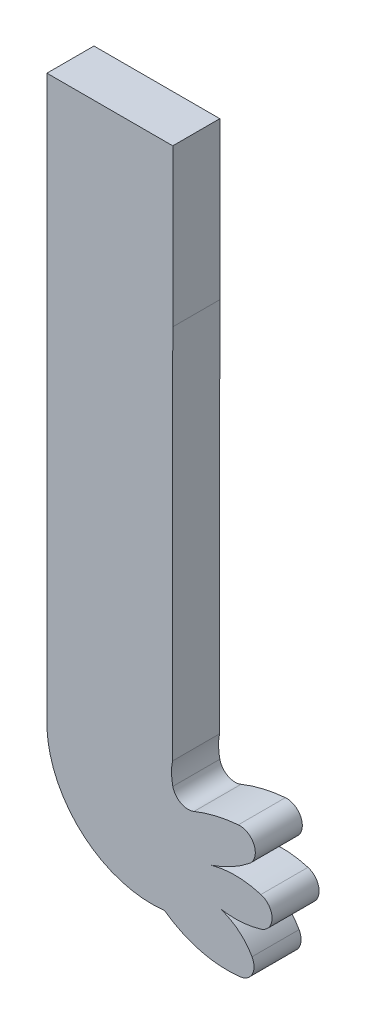
ISO-10303-21;
HEADER;
FILE_DESCRIPTION(('STEP AP214'),'2;1');
FILE_NAME('part.step','',(''),(''),'','','');
FILE_SCHEMA(('AUTOMOTIVE_DESIGN { 1 0 10303 214 1 1 1 1 }'));
ENDSEC;
DATA;
#1=APPLICATION_CONTEXT('core data for automotive mechanical design processes');
#2=APPLICATION_PROTOCOL_DEFINITION('international standard','automotive_design',2000,#1);
#3=PRODUCT_CONTEXT('',#1,'mechanical');
#4=PRODUCT('Part','Part','',(#3));
#5=PRODUCT_RELATED_PRODUCT_CATEGORY('part','',(#4));
#6=PRODUCT_DEFINITION_FORMATION('','',#4);
#7=PRODUCT_DEFINITION_CONTEXT('part definition',#1,'design');
#8=PRODUCT_DEFINITION('design','',#6,#7);
#9=PRODUCT_DEFINITION_SHAPE('','',#8);
#10=(LENGTH_UNIT() NAMED_UNIT(*) SI_UNIT(.MILLI.,.METRE.));
#11=(NAMED_UNIT(*) PLANE_ANGLE_UNIT() SI_UNIT($,.RADIAN.));
#12=(NAMED_UNIT(*) SI_UNIT($,.STERADIAN.) SOLID_ANGLE_UNIT());
#13=UNCERTAINTY_MEASURE_WITH_UNIT(LENGTH_MEASURE(1.E-05),#10,'distance_accuracy_value','');
#14=(GEOMETRIC_REPRESENTATION_CONTEXT(3) GLOBAL_UNCERTAINTY_ASSIGNED_CONTEXT((#13)) GLOBAL_UNIT_ASSIGNED_CONTEXT((#10,
#11,#12)) REPRESENTATION_CONTEXT('',''));
#15=CARTESIAN_POINT('',(0.,0.,0.));
#16=DIRECTION('',(0.,0.,1.));
#17=DIRECTION('',(1.,0.,0.));
#18=AXIS2_PLACEMENT_3D('',#15,#16,#17);
#19=CARTESIAN_POINT('',(34.1484606948639,3.81736043369854,3.));
#20=DIRECTION('',(0.,0.,-1.));
#21=DIRECTION('',(-1.,0.,0.));
#22=AXIS2_PLACEMENT_3D('',#19,#20,#21);
#23=CYLINDRICAL_SURFACE('',#22,6.68741064980928);
#24=CARTESIAN_POINT('',(34.1484606948639,3.81736043369854,0.));
#25=DIRECTION('',(0.,0.,1.));
#26=DIRECTION('',(1.,0.,0.));
#27=AXIS2_PLACEMENT_3D('',#24,#25,#26);
#28=CIRCLE('',#27,6.68741064980928);
#29=CARTESIAN_POINT('',(27.4679410773858,3.51384957776011,0.));
#30=VERTEX_POINT('',#29);
#31=CARTESIAN_POINT('',(34.9679410773858,-2.81965042223987,0.));
#32=VERTEX_POINT('',#31);
#33=EDGE_CURVE('E178',#30,#32,#28,.T.);
#34=ORIENTED_EDGE('',*,*,#33,.T.);
#35=DIRECTION('',(0.,0.,-1.));
#36=VECTOR('',#35,1.);
#37=CARTESIAN_POINT('',(34.9679410773858,-2.81965042223987,3.));
#38=LINE('',#37,#36);
#39=CARTESIAN_POINT('',(34.9679410773858,-2.81965042223987,3.));
#40=VERTEX_POINT('',#39);
#41=EDGE_CURVE('E11',#40,#32,#38,.T.);
#42=ORIENTED_EDGE('',*,*,#41,.F.);
#43=CARTESIAN_POINT('',(34.1484606948639,3.81736043369854,3.));
#44=DIRECTION('',(0.,0.,1.));
#45=DIRECTION('',(1.,0.,0.));
#46=AXIS2_PLACEMENT_3D('',#43,#44,#45);
#47=CIRCLE('',#46,6.68741064980928);
#48=CARTESIAN_POINT('',(27.4679410773858,3.51384957776011,3.));
#49=VERTEX_POINT('',#48);
#50=EDGE_CURVE('E209',#49,#40,#47,.T.);
#51=ORIENTED_EDGE('',*,*,#50,.F.);
#52=DIRECTION('',(0.,0.,-1.));
#53=VECTOR('',#52,1.);
#54=CARTESIAN_POINT('',(27.4679410773858,3.51384957776011,3.));
#55=LINE('',#54,#53);
#56=EDGE_CURVE('E174',#49,#30,#55,.T.);
#57=ORIENTED_EDGE('',*,*,#56,.T.);
#58=EDGE_LOOP('',(#34,#42,#51,#57));
#59=FACE_BOUND('',#58,.T.);
#60=ADVANCED_FACE('F33',(#59),#23,.T.);
#61=CARTESIAN_POINT('',(38.9679410773858,2.68034957775997,3.));
#62=DIRECTION('',(0.,0.,-1.));
#63=DIRECTION('',(-1.,0.,0.));
#64=AXIS2_PLACEMENT_3D('',#61,#62,#63);
#65=CYLINDRICAL_SURFACE('',#64,6.80073525436759);
#66=CARTESIAN_POINT('',(38.9679410773858,2.68034957775997,0.));
#67=DIRECTION('',(0.,0.,1.));
#68=DIRECTION('',(1.,0.,0.));
#69=AXIS2_PLACEMENT_3D('',#66,#67,#68);
#70=CIRCLE('',#69,6.80073525436759);
#71=CARTESIAN_POINT('',(39.8003595037792,-4.06924889647529,0.));
#72=VERTEX_POINT('',#71);
#73=EDGE_CURVE('E181',#32,#72,#70,.T.);
#74=ORIENTED_EDGE('',*,*,#73,.T.);
#75=DIRECTION('',(0.,0.,-1.));
#76=VECTOR('',#75,1.);
#77=CARTESIAN_POINT('',(39.8003595037792,-4.06924889647529,3.));
#78=LINE('',#77,#76);
#79=CARTESIAN_POINT('',(39.8003595037792,-4.06924889647529,3.));
#80=VERTEX_POINT('',#79);
#81=EDGE_CURVE('E41',#80,#72,#78,.T.);
#82=ORIENTED_EDGE('',*,*,#81,.F.);
#83=CARTESIAN_POINT('',(38.9679410773858,2.68034957775997,3.));
#84=DIRECTION('',(0.,0.,1.));
#85=DIRECTION('',(1.,0.,0.));
#86=AXIS2_PLACEMENT_3D('',#83,#84,#85);
#87=CIRCLE('',#86,6.80073525436759);
#88=EDGE_CURVE('E114',#40,#80,#87,.T.);
#89=ORIENTED_EDGE('',*,*,#88,.F.);
#90=ORIENTED_EDGE('',*,*,#41,.T.);
#91=EDGE_LOOP('',(#74,#82,#89,#90));
#92=FACE_BOUND('',#91,.T.);
#93=ADVANCED_FACE('F297',(#92),#65,.T.);
#94=CARTESIAN_POINT('',(39.6779582640223,-3.07676819817125,3.));
#95=DIRECTION('',(0.,0.,-1.));
#96=DIRECTION('',(-1.,0.,0.));
#97=AXIS2_PLACEMENT_3D('',#94,#95,#96);
#98=CYLINDRICAL_SURFACE('',#97,1.00000000000006);
#99=CARTESIAN_POINT('',(39.6779582640223,-3.07676819817125,0.));
#100=DIRECTION('',(0.,0.,1.));
#101=DIRECTION('',(1.,0.,0.));
#102=AXIS2_PLACEMENT_3D('',#99,#100,#101);
#103=CIRCLE('',#102,1.00000000000006);
#104=CARTESIAN_POINT('',(40.5495763407775,-2.58658259222829,0.));
#105=VERTEX_POINT('',#104);
#106=EDGE_CURVE('E183',#72,#105,#103,.T.);
#107=ORIENTED_EDGE('',*,*,#106,.T.);
#108=DIRECTION('',(0.,0.,-1.));
#109=VECTOR('',#108,1.);
#110=CARTESIAN_POINT('',(40.5495763407775,-2.58658259222829,3.));
#111=LINE('',#110,#109);
#112=CARTESIAN_POINT('',(40.5495763407775,-2.58658259222829,3.));
#113=VERTEX_POINT('',#112);
#114=EDGE_CURVE('E240',#113,#105,#111,.T.);
#115=ORIENTED_EDGE('',*,*,#114,.F.);
#116=CARTESIAN_POINT('',(39.6779582640223,-3.07676819817125,3.));
#117=DIRECTION('',(0.,0.,1.));
#118=DIRECTION('',(1.,0.,0.));
#119=AXIS2_PLACEMENT_3D('',#116,#117,#118);
#120=CIRCLE('',#119,1.00000000000006);
#121=EDGE_CURVE('E248',#80,#113,#120,.T.);
#122=ORIENTED_EDGE('',*,*,#121,.F.);
#123=ORIENTED_EDGE('',*,*,#81,.T.);
#124=EDGE_LOOP('',(#107,#115,#122,#123));
#125=FACE_BOUND('',#124,.T.);
#126=ADVANCED_FACE('F246',(#125),#98,.T.);
#127=CARTESIAN_POINT('',(37.4679410773858,-4.31965042223991,3.));
#128=DIRECTION('',(0.,0.,-1.));
#129=DIRECTION('',(-1.,0.,0.));
#130=AXIS2_PLACEMENT_3D('',#127,#128,#129);
#131=CYLINDRICAL_SURFACE('',#130,3.53553390593274);
#132=CARTESIAN_POINT('',(37.4679410773858,-4.31965042223991,0.));
#133=DIRECTION('',(0.,0.,1.));
#134=DIRECTION('',(1.,0.,0.));
#135=AXIS2_PLACEMENT_3D('',#132,#133,#134);
#136=CIRCLE('',#135,3.53553390593274);
#137=CARTESIAN_POINT('',(38.4973528420916,-0.937297481063413,0.));
#138=VERTEX_POINT('',#137);
#139=EDGE_CURVE('E185',#105,#138,#136,.T.);
#140=ORIENTED_EDGE('',*,*,#139,.T.);
#141=DIRECTION('',(0.,0.,-1.));
#142=VECTOR('',#141,1.);
#143=CARTESIAN_POINT('',(38.4973528420916,-0.937297481063413,3.));
#144=LINE('',#143,#142);
#145=CARTESIAN_POINT('',(38.4973528420916,-0.937297481063413,3.));
#146=VERTEX_POINT('',#145);
#147=EDGE_CURVE('E237',#146,#138,#144,.T.);
#148=ORIENTED_EDGE('',*,*,#147,.F.);
#149=CARTESIAN_POINT('',(37.4679410773858,-4.31965042223991,3.));
#150=DIRECTION('',(0.,0.,1.));
#151=DIRECTION('',(1.,0.,0.));
#152=AXIS2_PLACEMENT_3D('',#149,#150,#151);
#153=CIRCLE('',#152,3.53553390593274);
#154=EDGE_CURVE('E264',#113,#146,#153,.T.);
#155=ORIENTED_EDGE('',*,*,#154,.F.);
#156=ORIENTED_EDGE('',*,*,#114,.T.);
#157=EDGE_LOOP('',(#140,#148,#155,#156));
#158=FACE_BOUND('',#157,.T.);
#159=ADVANCED_FACE('F255',(#158),#131,.T.);
#160=CARTESIAN_POINT('',(39.4679410773858,4.68034957775999,3.));
#161=DIRECTION('',(0.,0.,-1.));
#162=DIRECTION('',(-1.,0.,0.));
#163=AXIS2_PLACEMENT_3D('',#160,#161,#162);
#164=CYLINDRICAL_SURFACE('',#163,5.70087712549557);
#165=CARTESIAN_POINT('',(39.4679410773858,4.68034957775999,0.));
#166=DIRECTION('',(0.,0.,1.));
#167=DIRECTION('',(1.,0.,0.));
#168=AXIS2_PLACEMENT_3D('',#165,#166,#167);
#169=CIRCLE('',#168,5.70087712549557);
#170=CARTESIAN_POINT('',(41.1166448777335,-0.776918583024999,0.));
#171=VERTEX_POINT('',#170);
#172=EDGE_CURVE('E187',#138,#171,#169,.T.);
#173=ORIENTED_EDGE('',*,*,#172,.T.);
#174=DIRECTION('',(0.,0.,-1.));
#175=VECTOR('',#174,1.);
#176=CARTESIAN_POINT('',(41.1166448777335,-0.776918583024999,3.));
#177=LINE('',#176,#175);
#178=CARTESIAN_POINT('',(41.1166448777335,-0.776918583024999,3.));
#179=VERTEX_POINT('',#178);
#180=EDGE_CURVE('E234',#179,#171,#177,.T.);
#181=ORIENTED_EDGE('',*,*,#180,.F.);
#182=CARTESIAN_POINT('',(39.4679410773858,4.68034957775999,3.));
#183=DIRECTION('',(0.,0.,1.));
#184=DIRECTION('',(1.,0.,0.));
#185=AXIS2_PLACEMENT_3D('',#182,#183,#184);
#186=CIRCLE('',#185,5.70087712549557);
#187=EDGE_CURVE('E261',#146,#179,#186,.T.);
#188=ORIENTED_EDGE('',*,*,#187,.F.);
#189=ORIENTED_EDGE('',*,*,#147,.T.);
#190=EDGE_LOOP('',(#173,#181,#188,#189));
#191=FACE_BOUND('',#190,.T.);
#192=ADVANCED_FACE('F259',(#191),#164,.T.);
#193=CARTESIAN_POINT('',(40.8274430998222,0.180349577760139,3.));
#194=DIRECTION('',(0.,0.,-1.));
#195=DIRECTION('',(-1.,0.,0.));
#196=AXIS2_PLACEMENT_3D('',#193,#194,#195);
#197=CYLINDRICAL_SURFACE('',#196,1.);
#198=CARTESIAN_POINT('',(40.8274430998222,0.180349577760139,0.));
#199=DIRECTION('',(0.,0.,1.));
#200=DIRECTION('',(1.,0.,0.));
#201=AXIS2_PLACEMENT_3D('',#198,#199,#200);
#202=CIRCLE('',#201,1.);
#203=CARTESIAN_POINT('',(41.1166448777336,1.13761773854525,0.));
#204=VERTEX_POINT('',#203);
#205=EDGE_CURVE('E189',#171,#204,#202,.T.);
#206=ORIENTED_EDGE('',*,*,#205,.T.);
#207=DIRECTION('',(0.,0.,-1.));
#208=VECTOR('',#207,1.);
#209=CARTESIAN_POINT('',(41.1166448777336,1.13761773854525,3.));
#210=LINE('',#209,#208);
#211=CARTESIAN_POINT('',(41.1166448777336,1.13761773854525,3.));
#212=VERTEX_POINT('',#211);
#213=EDGE_CURVE('E231',#212,#204,#210,.T.);
#214=ORIENTED_EDGE('',*,*,#213,.F.);
#215=CARTESIAN_POINT('',(40.8274430998222,0.180349577760139,3.));
#216=DIRECTION('',(0.,0.,1.));
#217=DIRECTION('',(1.,0.,0.));
#218=AXIS2_PLACEMENT_3D('',#215,#216,#217);
#219=CIRCLE('',#218,1.);
#220=EDGE_CURVE('E263',#179,#212,#219,.T.);
#221=ORIENTED_EDGE('',*,*,#220,.F.);
#222=ORIENTED_EDGE('',*,*,#180,.T.);
#223=EDGE_LOOP('',(#206,#214,#221,#222));
#224=FACE_BOUND('',#223,.T.);
#225=ADVANCED_FACE('F309',(#224),#197,.T.);
#226=CARTESIAN_POINT('',(39.4679410773859,-4.31965042223991,3.));
#227=DIRECTION('',(0.,0.,-1.));
#228=DIRECTION('',(-1.,0.,0.));
#229=AXIS2_PLACEMENT_3D('',#226,#227,#228);
#230=CYLINDRICAL_SURFACE('',#229,5.70087712549574);
#231=CARTESIAN_POINT('',(39.4679410773859,-4.31965042223991,0.));
#232=DIRECTION('',(0.,0.,1.));
#233=DIRECTION('',(1.,0.,0.));
#234=AXIS2_PLACEMENT_3D('',#231,#232,#233);
#235=CIRCLE('',#234,5.70087712549574);
#236=CARTESIAN_POINT('',(37.9679410773858,1.18034957776012,0.));
#237=VERTEX_POINT('',#236);
#238=EDGE_CURVE('E191',#204,#237,#235,.T.);
#239=ORIENTED_EDGE('',*,*,#238,.T.);
#240=DIRECTION('',(0.,0.,-1.));
#241=VECTOR('',#240,1.);
#242=CARTESIAN_POINT('',(37.9679410773858,1.18034957776012,3.));
#243=LINE('',#242,#241);
#244=CARTESIAN_POINT('',(37.9679410773858,1.18034957776012,3.));
#245=VERTEX_POINT('',#244);
#246=EDGE_CURVE('E228',#245,#237,#243,.T.);
#247=ORIENTED_EDGE('',*,*,#246,.F.);
#248=CARTESIAN_POINT('',(39.4679410773859,-4.31965042223991,3.));
#249=DIRECTION('',(0.,0.,1.));
#250=DIRECTION('',(1.,0.,0.));
#251=AXIS2_PLACEMENT_3D('',#248,#249,#250);
#252=CIRCLE('',#251,5.70087712549574);
#253=EDGE_CURVE('E266',#212,#245,#252,.T.);
#254=ORIENTED_EDGE('',*,*,#253,.F.);
#255=ORIENTED_EDGE('',*,*,#213,.T.);
#256=EDGE_LOOP('',(#239,#247,#254,#255));
#257=FACE_BOUND('',#256,.T.);
#258=ADVANCED_FACE('F312',(#257),#230,.T.);
#259=CARTESIAN_POINT('',(35.4679410773858,8.68034957776011,3.));
#260=DIRECTION('',(0.,0.,-1.));
#261=DIRECTION('',(-1.,0.,0.));
#262=AXIS2_PLACEMENT_3D('',#259,#260,#261);
#263=CYLINDRICAL_SURFACE('',#262,7.90569415042093);
#264=CARTESIAN_POINT('',(35.4679410773858,8.68034957776011,0.));
#265=DIRECTION('',(0.,0.,1.));
#266=DIRECTION('',(1.,0.,0.));
#267=AXIS2_PLACEMENT_3D('',#264,#265,#266);
#268=CIRCLE('',#267,7.90569415042093);
#269=CARTESIAN_POINT('',(40.3790237950045,2.48508795772284,0.));
#270=VERTEX_POINT('',#269);
#271=EDGE_CURVE('E193',#237,#270,#268,.T.);
#272=ORIENTED_EDGE('',*,*,#271,.T.);
#273=DIRECTION('',(0.,0.,-1.));
#274=VECTOR('',#273,1.);
#275=CARTESIAN_POINT('',(40.3790237950045,2.48508795772284,3.));
#276=LINE('',#275,#274);
#277=CARTESIAN_POINT('',(40.3790237950045,2.48508795772284,3.));
#278=VERTEX_POINT('',#277);
#279=EDGE_CURVE('E225',#278,#270,#276,.T.);
#280=ORIENTED_EDGE('',*,*,#279,.F.);
#281=CARTESIAN_POINT('',(35.4679410773858,8.68034957776011,3.));
#282=DIRECTION('',(0.,0.,1.));
#283=DIRECTION('',(1.,0.,0.));
#284=AXIS2_PLACEMENT_3D('',#281,#282,#283);
#285=CIRCLE('',#284,7.90569415042093);
#286=EDGE_CURVE('E272',#245,#278,#285,.T.);
#287=ORIENTED_EDGE('',*,*,#286,.F.);
#288=ORIENTED_EDGE('',*,*,#246,.T.);
#289=EDGE_LOOP('',(#272,#280,#287,#288));
#290=FACE_BOUND('',#289,.T.);
#291=ADVANCED_FACE('F316',(#290),#263,.T.);
#292=CARTESIAN_POINT('',(39.7578155083979,3.26873345452055,3.));
#293=DIRECTION('',(0.,0.,-1.));
#294=DIRECTION('',(-1.,0.,0.));
#295=AXIS2_PLACEMENT_3D('',#292,#293,#294);
#296=CYLINDRICAL_SURFACE('',#295,1.00000000000001);
#297=CARTESIAN_POINT('',(39.7578155083979,3.26873345452055,0.));
#298=DIRECTION('',(0.,0.,1.));
#299=DIRECTION('',(1.,0.,0.));
#300=AXIS2_PLACEMENT_3D('',#297,#298,#299);
#301=CIRCLE('',#300,1.00000000000001);
#302=CARTESIAN_POINT('',(39.6754122887833,4.26533252606194,0.));
#303=VERTEX_POINT('',#302);
#304=EDGE_CURVE('E195',#270,#303,#301,.T.);
#305=ORIENTED_EDGE('',*,*,#304,.T.);
#306=DIRECTION('',(0.,0.,-1.));
#307=VECTOR('',#306,1.);
#308=CARTESIAN_POINT('',(39.6754122887833,4.26533252606194,3.));
#309=LINE('',#308,#307);
#310=CARTESIAN_POINT('',(39.6754122887833,4.26533252606194,3.));
#311=VERTEX_POINT('',#310);
#312=EDGE_CURVE('E222',#311,#303,#309,.T.);
#313=ORIENTED_EDGE('',*,*,#312,.F.);
#314=CARTESIAN_POINT('',(39.7578155083979,3.26873345452055,3.));
#315=DIRECTION('',(0.,0.,1.));
#316=DIRECTION('',(1.,0.,0.));
#317=AXIS2_PLACEMENT_3D('',#314,#315,#316);
#318=CIRCLE('',#317,1.00000000000001);
#319=EDGE_CURVE('E274',#278,#311,#318,.T.);
#320=ORIENTED_EDGE('',*,*,#319,.F.);
#321=ORIENTED_EDGE('',*,*,#279,.T.);
#322=EDGE_LOOP('',(#305,#313,#320,#321));
#323=FACE_BOUND('',#322,.T.);
#324=ADVANCED_FACE('F320',(#323),#296,.T.);
#325=CARTESIAN_POINT('',(40.4679410773858,-5.31965042223965,3.));
#326=DIRECTION('',(0.,0.,-1.));
#327=DIRECTION('',(-1.,0.,0.));
#328=AXIS2_PLACEMENT_3D('',#325,#326,#327);
#329=CYLINDRICAL_SURFACE('',#328,9.61769203083546);
#330=CARTESIAN_POINT('',(40.4679410773858,-5.31965042223965,0.));
#331=DIRECTION('',(0.,0.,1.));
#332=DIRECTION('',(1.,0.,0.));
#333=AXIS2_PLACEMENT_3D('',#330,#331,#332);
#334=CIRCLE('',#333,9.61769203083546);
#335=CARTESIAN_POINT('',(36.8493463261999,3.59134121880042,0.));
#336=VERTEX_POINT('',#335);
#337=EDGE_CURVE('E197',#303,#336,#334,.T.);
#338=ORIENTED_EDGE('',*,*,#337,.T.);
#339=DIRECTION('',(0.,0.,-1.));
#340=VECTOR('',#339,1.);
#341=CARTESIAN_POINT('',(36.8493463261999,3.59134121880042,3.));
#342=LINE('',#341,#340);
#343=CARTESIAN_POINT('',(36.8493463261999,3.59134121880042,3.));
#344=VERTEX_POINT('',#343);
#345=EDGE_CURVE('E219',#344,#336,#342,.T.);
#346=ORIENTED_EDGE('',*,*,#345,.F.);
#347=CARTESIAN_POINT('',(40.4679410773858,-5.31965042223965,3.));
#348=DIRECTION('',(0.,0.,1.));
#349=DIRECTION('',(1.,0.,0.));
#350=AXIS2_PLACEMENT_3D('',#347,#348,#349);
#351=CIRCLE('',#350,9.61769203083546);
#352=EDGE_CURVE('E276',#311,#344,#351,.T.);
#353=ORIENTED_EDGE('',*,*,#352,.F.);
#354=ORIENTED_EDGE('',*,*,#312,.T.);
#355=EDGE_LOOP('',(#338,#346,#353,#354));
#356=FACE_BOUND('',#355,.T.);
#357=ADVANCED_FACE('F324',(#356),#329,.T.);
#358=CARTESIAN_POINT('',(36.4731027596993,4.51786201115584,3.));
#359=DIRECTION('',(0.,0.,-1.));
#360=DIRECTION('',(-1.,0.,0.));
#361=AXIS2_PLACEMENT_3D('',#358,#359,#360);
#362=CYLINDRICAL_SURFACE('',#361,0.999999999999996);
#363=CARTESIAN_POINT('',(36.4731027596993,4.51786201115584,0.));
#364=DIRECTION('',(0.,0.,-1.));
#365=DIRECTION('',(1.,0.,0.));
#366=AXIS2_PLACEMENT_3D('',#363,#364,#365);
#367=CIRCLE('',#366,0.999999999999996);
#368=CARTESIAN_POINT('',(35.4972057886956,4.29963024906374,0.));
#369=VERTEX_POINT('',#368);
#370=EDGE_CURVE('E199',#336,#369,#367,.T.);
#371=ORIENTED_EDGE('',*,*,#370,.T.);
#372=DIRECTION('',(0.,0.,-1.));
#373=VECTOR('',#372,1.);
#374=CARTESIAN_POINT('',(35.4972057886956,4.29963024906374,3.));
#375=LINE('',#374,#373);
#376=CARTESIAN_POINT('',(35.4972057886956,4.29963024906374,3.));
#377=VERTEX_POINT('',#376);
#378=EDGE_CURVE('E216',#377,#369,#375,.T.);
#379=ORIENTED_EDGE('',*,*,#378,.F.);
#380=CARTESIAN_POINT('',(36.4731027596993,4.51786201115584,3.));
#381=DIRECTION('',(0.,0.,-1.));
#382=DIRECTION('',(1.,0.,0.));
#383=AXIS2_PLACEMENT_3D('',#380,#381,#382);
#384=CIRCLE('',#383,0.999999999999996);
#385=EDGE_CURVE('E278',#344,#377,#384,.T.);
#386=ORIENTED_EDGE('',*,*,#385,.F.);
#387=ORIENTED_EDGE('',*,*,#345,.T.);
#388=EDGE_LOOP('',(#371,#379,#386,#387));
#389=FACE_BOUND('',#388,.T.);
#390=ADVANCED_FACE('F328',(#389),#362,.F.);
#391=CARTESIAN_POINT('',(38.8413859750047,5.04746158423147,3.));
#392=DIRECTION('',(0.,0.,-1.));
#393=DIRECTION('',(-1.,0.,0.));
#394=AXIS2_PLACEMENT_3D('',#391,#392,#393);
#395=CYLINDRICAL_SURFACE('',#394,3.42677586433096);
#396=CARTESIAN_POINT('',(38.8413859750047,5.04746158423147,0.));
#397=DIRECTION('',(0.,0.,-1.));
#398=DIRECTION('',(1.,0.,0.));
#399=AXIS2_PLACEMENT_3D('',#396,#397,#398);
#400=CIRCLE('',#399,3.42677586433096);
#401=CARTESIAN_POINT('',(35.4760513314161,5.69346124446622,0.));
#402=VERTEX_POINT('',#401);
#403=EDGE_CURVE('E201',#369,#402,#400,.T.);
#404=ORIENTED_EDGE('',*,*,#403,.T.);
#405=DIRECTION('',(0.,0.,-1.));
#406=VECTOR('',#405,1.);
#407=CARTESIAN_POINT('',(35.4760513314161,5.69346124446622,3.));
#408=LINE('',#407,#406);
#409=CARTESIAN_POINT('',(35.4760513314161,5.69346124446622,3.));
#410=VERTEX_POINT('',#409);
#411=EDGE_CURVE('E213',#410,#402,#408,.T.);
#412=ORIENTED_EDGE('',*,*,#411,.F.);
#413=CARTESIAN_POINT('',(38.8413859750047,5.04746158423147,3.));
#414=DIRECTION('',(0.,0.,-1.));
#415=DIRECTION('',(1.,0.,0.));
#416=AXIS2_PLACEMENT_3D('',#413,#414,#415);
#417=CIRCLE('',#416,3.42677586433096);
#418=EDGE_CURVE('E280',#377,#410,#417,.T.);
#419=ORIENTED_EDGE('',*,*,#418,.F.);
#420=ORIENTED_EDGE('',*,*,#378,.T.);
#421=EDGE_LOOP('',(#404,#412,#419,#420));
#422=FACE_BOUND('',#421,.T.);
#423=ADVANCED_FACE('F286',(#422),#395,.F.);
#424=CARTESIAN_POINT('',(35.4760513314161,5.69346124446622,3.));
#425=DIRECTION('',(-0.99999972063611,0.000747480903385266,0.));
#426=DIRECTION('',(-0.000747480903385266,-0.999999720636111,0.));
#427=AXIS2_PLACEMENT_3D('',#424,#425,#426);
#428=PLANE('',#427);
#429=DIRECTION('',(0.000747480903385266,0.99999972063611,0.));
#430=VECTOR('',#429,1.);
#431=CARTESIAN_POINT('',(35.4760513314161,5.69346124446622,0.));
#432=LINE('',#431,#430);
#433=CARTESIAN_POINT('',(35.4939810773858,29.6803495777601,0.));
#434=VERTEX_POINT('',#433);
#435=EDGE_CURVE('E203',#402,#434,#432,.T.);
#436=ORIENTED_EDGE('',*,*,#435,.T.);
#437=DIRECTION('',(0.,0.,-1.));
#438=VECTOR('',#437,1.);
#439=CARTESIAN_POINT('',(35.4939810773858,29.6803495777601,3.));
#440=LINE('',#439,#438);
#441=CARTESIAN_POINT('',(35.4939810773858,29.6803495777601,3.));
#442=VERTEX_POINT('',#441);
#443=EDGE_CURVE('E169',#442,#434,#440,.T.);
#444=ORIENTED_EDGE('',*,*,#443,.F.);
#445=DIRECTION('',(0.000747480903385266,0.99999972063611,0.));
#446=VECTOR('',#445,1.);
#447=CARTESIAN_POINT('',(35.4760513314161,5.69346124446622,3.));
#448=LINE('',#447,#446);
#449=EDGE_CURVE('E158',#410,#442,#448,.T.);
#450=ORIENTED_EDGE('',*,*,#449,.F.);
#451=ORIENTED_EDGE('',*,*,#411,.T.);
#452=EDGE_LOOP('',(#436,#444,#450,#451));
#453=FACE_BOUND('',#452,.T.);
#454=ADVANCED_FACE('F290',(#453),#428,.F.);
#455=CARTESIAN_POINT('',(35.4939810773858,29.6803495777601,3.));
#456=DIRECTION('',(-1.,0.,0.));
#457=DIRECTION('',(0.,0.,1.));
#458=AXIS2_PLACEMENT_3D('',#455,#456,#457);
#459=PLANE('',#458);
#460=DIRECTION('',(0.,1.,0.));
#461=VECTOR('',#460,1.);
#462=CARTESIAN_POINT('',(35.4939810773858,29.6803495777601,0.));
#463=LINE('',#462,#461);
#464=CARTESIAN_POINT('',(35.4939810773858,39.6803495777601,0.));
#465=VERTEX_POINT('',#464);
#466=EDGE_CURVE('E167',#434,#465,#463,.T.);
#467=ORIENTED_EDGE('',*,*,#466,.T.);
#468=DIRECTION('',(0.,0.,-1.));
#469=VECTOR('',#468,1.);
#470=CARTESIAN_POINT('',(35.4939810773858,39.6803495777601,3.));
#471=LINE('',#470,#469);
#472=CARTESIAN_POINT('',(35.4939810773858,39.6803495777601,3.));
#473=VERTEX_POINT('',#472);
#474=EDGE_CURVE('E164',#473,#465,#471,.T.);
#475=ORIENTED_EDGE('',*,*,#474,.F.);
#476=DIRECTION('',(0.,1.,0.));
#477=VECTOR('',#476,1.);
#478=CARTESIAN_POINT('',(35.4939810773858,29.6803495777601,3.));
#479=LINE('',#478,#477);
#480=EDGE_CURVE('E151',#442,#473,#479,.T.);
#481=ORIENTED_EDGE('',*,*,#480,.F.);
#482=ORIENTED_EDGE('',*,*,#443,.T.);
#483=EDGE_LOOP('',(#467,#475,#481,#482));
#484=FACE_BOUND('',#483,.T.);
#485=ADVANCED_FACE('F165',(#484),#459,.F.);
#486=CARTESIAN_POINT('',(35.4939810773858,39.6803495777601,3.));
#487=DIRECTION('',(3.46337782755286E-12,-1.,0.));
#488=DIRECTION('',(1.,3.46337782755286E-12,0.));
#489=AXIS2_PLACEMENT_3D('',#486,#487,#488);
#490=PLANE('',#489);
#491=DIRECTION('',(-1.,-3.46337782755286E-12,0.));
#492=VECTOR('',#491,1.);
#493=CARTESIAN_POINT('',(35.4939810773858,39.6803495777601,0.));
#494=LINE('',#493,#492);
#495=CARTESIAN_POINT('',(27.4679410773858,39.6803495777323,0.));
#496=VERTEX_POINT('',#495);
#497=EDGE_CURVE('E206',#465,#496,#494,.T.);
#498=ORIENTED_EDGE('',*,*,#497,.T.);
#499=DIRECTION('',(0.,0.,-1.));
#500=VECTOR('',#499,1.);
#501=CARTESIAN_POINT('',(27.4679410773858,39.6803495777323,3.));
#502=LINE('',#501,#500);
#503=CARTESIAN_POINT('',(27.4679410773858,39.6803495777323,3.));
#504=VERTEX_POINT('',#503);
#505=EDGE_CURVE('E170',#504,#496,#502,.T.);
#506=ORIENTED_EDGE('',*,*,#505,.F.);
#507=DIRECTION('',(-1.,-3.46337782755286E-12,0.));
#508=VECTOR('',#507,1.);
#509=CARTESIAN_POINT('',(35.4939810773858,39.6803495777601,3.));
#510=LINE('',#509,#508);
#511=EDGE_CURVE('E155',#473,#504,#510,.T.);
#512=ORIENTED_EDGE('',*,*,#511,.F.);
#513=ORIENTED_EDGE('',*,*,#474,.T.);
#514=EDGE_LOOP('',(#498,#506,#512,#513));
#515=FACE_BOUND('',#514,.T.);
#516=ADVANCED_FACE('F172',(#515),#490,.F.);
#517=CARTESIAN_POINT('',(27.4679410773858,3.51384957776011,3.));
#518=DIRECTION('',(1.,0.,0.));
#519=DIRECTION('',(0.,0.,-1.));
#520=AXIS2_PLACEMENT_3D('',#517,#518,#519);
#521=PLANE('',#520);
#522=DIRECTION('',(0.,-1.,0.));
#523=VECTOR('',#522,1.);
#524=CARTESIAN_POINT('',(27.4679410773858,3.51384957776011,0.));
#525=LINE('',#524,#523);
#526=EDGE_CURVE('E102',#496,#30,#525,.T.);
#527=ORIENTED_EDGE('',*,*,#526,.T.);
#528=ORIENTED_EDGE('',*,*,#56,.F.);
#529=DIRECTION('',(0.,-1.,0.));
#530=VECTOR('',#529,1.);
#531=CARTESIAN_POINT('',(27.4679410773858,39.6803495777323,3.));
#532=LINE('',#531,#530);
#533=EDGE_CURVE('E49',#504,#49,#532,.T.);
#534=ORIENTED_EDGE('',*,*,#533,.F.);
#535=ORIENTED_EDGE('',*,*,#505,.T.);
#536=EDGE_LOOP('',(#527,#528,#534,#535));
#537=FACE_BOUND('',#536,.T.);
#538=ADVANCED_FACE('F291',(#537),#521,.F.);
#539=CARTESIAN_POINT('',(34.1484606948639,3.81736043369854,3.));
#540=DIRECTION('',(0.,0.,1.));
#541=DIRECTION('',(1.,0.,0.));
#542=AXIS2_PLACEMENT_3D('',#539,#540,#541);
#543=PLANE('',#542);
#544=ORIENTED_EDGE('',*,*,#50,.T.);
#545=ORIENTED_EDGE('',*,*,#88,.T.);
#546=ORIENTED_EDGE('',*,*,#121,.T.);
#547=ORIENTED_EDGE('',*,*,#154,.T.);
#548=ORIENTED_EDGE('',*,*,#187,.T.);
#549=ORIENTED_EDGE('',*,*,#220,.T.);
#550=ORIENTED_EDGE('',*,*,#253,.T.);
#551=ORIENTED_EDGE('',*,*,#286,.T.);
#552=ORIENTED_EDGE('',*,*,#319,.T.);
#553=ORIENTED_EDGE('',*,*,#352,.T.);
#554=ORIENTED_EDGE('',*,*,#385,.T.);
#555=ORIENTED_EDGE('',*,*,#418,.T.);
#556=ORIENTED_EDGE('',*,*,#449,.T.);
#557=ORIENTED_EDGE('',*,*,#480,.T.);
#558=ORIENTED_EDGE('',*,*,#511,.T.);
#559=ORIENTED_EDGE('',*,*,#533,.T.);
#560=EDGE_LOOP('',(#544,#545,#546,#547,#548,#549,#550,#551,#552,#553,#554,#555,#556,#557,#558,#559));
#561=FACE_BOUND('',#560,.T.);
#562=ADVANCED_FACE('F153',(#561),#543,.T.);
#563=CARTESIAN_POINT('',(34.1484606948639,3.81736043369854,0.));
#564=DIRECTION('',(0.,0.,1.));
#565=DIRECTION('',(1.,0.,0.));
#566=AXIS2_PLACEMENT_3D('',#563,#564,#565);
#567=PLANE('',#566);
#568=ORIENTED_EDGE('',*,*,#33,.F.);
#569=ORIENTED_EDGE('',*,*,#526,.F.);
#570=ORIENTED_EDGE('',*,*,#497,.F.);
#571=ORIENTED_EDGE('',*,*,#466,.F.);
#572=ORIENTED_EDGE('',*,*,#435,.F.);
#573=ORIENTED_EDGE('',*,*,#403,.F.);
#574=ORIENTED_EDGE('',*,*,#370,.F.);
#575=ORIENTED_EDGE('',*,*,#337,.F.);
#576=ORIENTED_EDGE('',*,*,#304,.F.);
#577=ORIENTED_EDGE('',*,*,#271,.F.);
#578=ORIENTED_EDGE('',*,*,#238,.F.);
#579=ORIENTED_EDGE('',*,*,#205,.F.);
#580=ORIENTED_EDGE('',*,*,#172,.F.);
#581=ORIENTED_EDGE('',*,*,#139,.F.);
#582=ORIENTED_EDGE('',*,*,#106,.F.);
#583=ORIENTED_EDGE('',*,*,#73,.F.);
#584=EDGE_LOOP('',(#568,#569,#570,#571,#572,#573,#574,#575,#576,#577,#578,#579,#580,#581,#582,#583));
#585=FACE_BOUND('',#584,.T.);
#586=ADVANCED_FACE('F250',(#585),#567,.F.);
#587=CLOSED_SHELL('',(#60,#93,#126,#159,#192,#225,#258,#291,#324,#357,#390,#423,#454,#485,#516,
#538,#562,#586));
#588=MANIFOLD_SOLID_BREP('B2',#587);
#589=ADVANCED_BREP_SHAPE_REPRESENTATION('',(#18,#588),#14);
#590=SHAPE_DEFINITION_REPRESENTATION(#9,#589);
ENDSEC;
END-ISO-10303-21;
